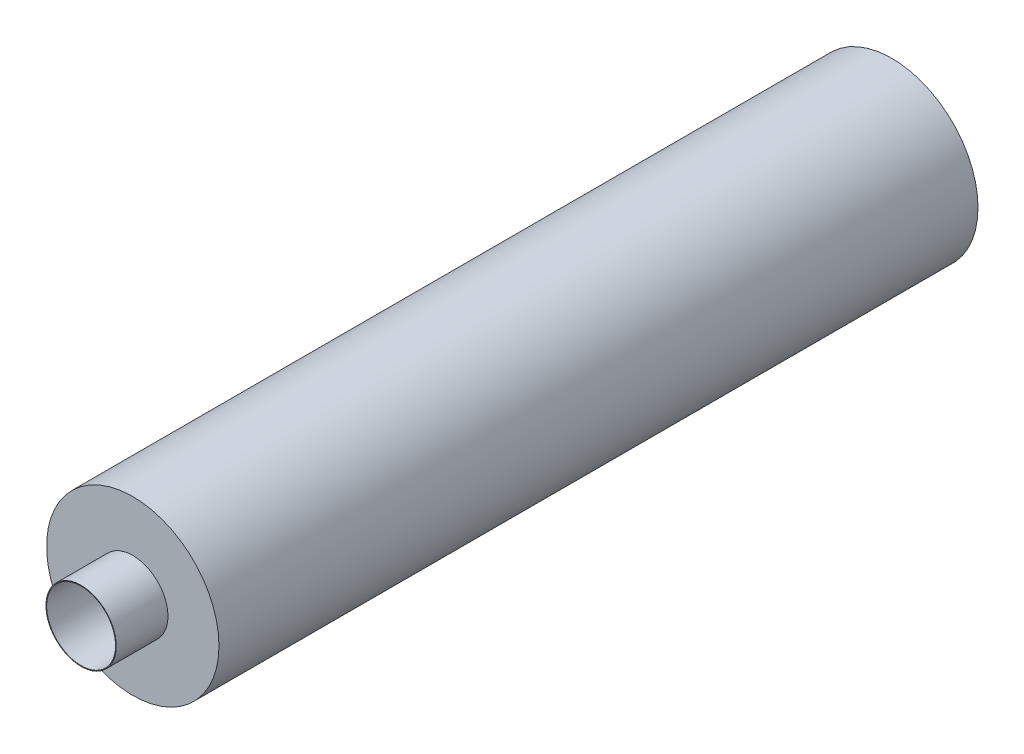
ISO-10303-21;
HEADER;
FILE_DESCRIPTION(('STEP AP214'),'2;1');
FILE_NAME('part.step','',(''),(''),'','','');
FILE_SCHEMA(('AUTOMOTIVE_DESIGN { 1 0 10303 214 1 1 1 1 }'));
ENDSEC;
DATA;
#1=APPLICATION_CONTEXT('core data for automotive mechanical design processes');
#2=APPLICATION_PROTOCOL_DEFINITION('international standard','automotive_design',2000,#1);
#3=PRODUCT_CONTEXT('',#1,'mechanical');
#4=PRODUCT('Part','Part','',(#3));
#5=PRODUCT_RELATED_PRODUCT_CATEGORY('part','',(#4));
#6=PRODUCT_DEFINITION_FORMATION('','',#4);
#7=PRODUCT_DEFINITION_CONTEXT('part definition',#1,'design');
#8=PRODUCT_DEFINITION('design','',#6,#7);
#9=PRODUCT_DEFINITION_SHAPE('','',#8);
#10=(LENGTH_UNIT() NAMED_UNIT(*) SI_UNIT(.MILLI.,.METRE.));
#11=(NAMED_UNIT(*) PLANE_ANGLE_UNIT() SI_UNIT($,.RADIAN.));
#12=(NAMED_UNIT(*) SI_UNIT($,.STERADIAN.) SOLID_ANGLE_UNIT());
#13=UNCERTAINTY_MEASURE_WITH_UNIT(LENGTH_MEASURE(1.E-05),#10,'distance_accuracy_value','');
#14=(GEOMETRIC_REPRESENTATION_CONTEXT(3) GLOBAL_UNCERTAINTY_ASSIGNED_CONTEXT((#13)) GLOBAL_UNIT_ASSIGNED_CONTEXT((#10,
#11,#12)) REPRESENTATION_CONTEXT('',''));
#15=CARTESIAN_POINT('',(0.,0.,0.));
#16=DIRECTION('',(0.,0.,1.));
#17=DIRECTION('',(1.,0.,0.));
#18=AXIS2_PLACEMENT_3D('',#15,#16,#17);
#19=CARTESIAN_POINT('',(0.,0.,2200.));
#20=DIRECTION('',(0.,0.,1.));
#21=DIRECTION('',(1.,0.,0.));
#22=AXIS2_PLACEMENT_3D('',#19,#20,#21);
#23=PLANE('',#22);
#24=CARTESIAN_POINT('',(0.,0.,2200.));
#25=DIRECTION('',(0.,0.,1.));
#26=DIRECTION('',(1.,0.,0.));
#27=AXIS2_PLACEMENT_3D('',#24,#25,#26);
#28=CIRCLE('',#27,100.);
#29=CARTESIAN_POINT('',(100.,0.,2200.));
#30=VERTEX_POINT('',#29);
#31=EDGE_CURVE('E67',#30,#30,#28,.T.);
#32=ORIENTED_EDGE('',*,*,#31,.T.);
#33=EDGE_LOOP('',(#32));
#34=FACE_BOUND('',#33,.T.);
#35=CARTESIAN_POINT('',(0.,0.,2200.));
#36=DIRECTION('',(0.,0.,1.));
#37=DIRECTION('',(1.,0.,0.));
#38=AXIS2_PLACEMENT_3D('',#35,#36,#37);
#39=CIRCLE('',#38,248.);
#40=CARTESIAN_POINT('',(248.,0.,2200.));
#41=VERTEX_POINT('',#40);
#42=EDGE_CURVE('E56',#41,#41,#39,.T.);
#43=ORIENTED_EDGE('',*,*,#42,.F.);
#44=EDGE_LOOP('',(#43));
#45=FACE_BOUND('',#44,.T.);
#46=ADVANCED_FACE('F43',(#34,#45),#23,.F.);
#47=CARTESIAN_POINT('',(0.,0.,2202.));
#48=DIRECTION('',(0.,0.,-1.));
#49=DIRECTION('',(-1.,0.,0.));
#50=AXIS2_PLACEMENT_3D('',#47,#48,#49);
#51=CYLINDRICAL_SURFACE('',#50,100.);
#52=ORIENTED_EDGE('',*,*,#31,.F.);
#53=EDGE_LOOP('',(#52));
#54=FACE_BOUND('',#53,.T.);
#55=CARTESIAN_POINT('',(0.,0.,2352.));
#56=DIRECTION('',(0.,0.,1.));
#57=DIRECTION('',(1.,0.,0.));
#58=AXIS2_PLACEMENT_3D('',#55,#56,#57);
#59=CIRCLE('',#58,100.);
#60=CARTESIAN_POINT('',(100.,0.,2352.));
#61=VERTEX_POINT('',#60);
#62=EDGE_CURVE('E76',#61,#61,#59,.T.);
#63=ORIENTED_EDGE('',*,*,#62,.T.);
#64=EDGE_LOOP('',(#63));
#65=FACE_BOUND('',#64,.T.);
#66=ADVANCED_FACE('F84',(#54,#65),#51,.F.);
#67=CARTESIAN_POINT('',(0.,0.,2.));
#68=DIRECTION('',(0.,0.,1.));
#69=DIRECTION('',(1.,0.,0.));
#70=AXIS2_PLACEMENT_3D('',#67,#68,#69);
#71=PLANE('',#70);
#72=CARTESIAN_POINT('',(0.,0.,1.99999999999978));
#73=DIRECTION('',(0.,0.,1.));
#74=DIRECTION('',(1.,0.,0.));
#75=AXIS2_PLACEMENT_3D('',#72,#73,#74);
#76=CIRCLE('',#75,248.);
#77=CARTESIAN_POINT('',(248.,0.,1.99999999999978));
#78=VERTEX_POINT('',#77);
#79=EDGE_CURVE('E51',#78,#78,#76,.T.);
#80=ORIENTED_EDGE('',*,*,#79,.T.);
#81=EDGE_LOOP('',(#80));
#82=FACE_BOUND('',#81,.T.);
#83=ADVANCED_FACE('F99',(#82),#71,.T.);
#84=CARTESIAN_POINT('',(0.,0.,2200.));
#85=DIRECTION('',(0.,0.,-1.));
#86=DIRECTION('',(-1.,0.,0.));
#87=AXIS2_PLACEMENT_3D('',#84,#85,#86);
#88=CYLINDRICAL_SURFACE('',#87,248.);
#89=ORIENTED_EDGE('',*,*,#42,.T.);
#90=EDGE_LOOP('',(#89));
#91=FACE_BOUND('',#90,.T.);
#92=ORIENTED_EDGE('',*,*,#79,.F.);
#93=EDGE_LOOP('',(#92));
#94=FACE_BOUND('',#93,.T.);
#95=ADVANCED_FACE('F89',(#91,#94),#88,.F.);
#96=CARTESIAN_POINT('',(0.,0.,2352.));
#97=DIRECTION('',(0.,0.,1.));
#98=DIRECTION('',(1.,0.,0.));
#99=AXIS2_PLACEMENT_3D('',#96,#97,#98);
#100=PLANE('',#99);
#101=CARTESIAN_POINT('',(0.,0.,2352.));
#102=DIRECTION('',(0.,0.,1.));
#103=DIRECTION('',(1.,0.,0.));
#104=AXIS2_PLACEMENT_3D('',#101,#102,#103);
#105=CIRCLE('',#104,102.);
#106=CARTESIAN_POINT('',(102.,0.,2352.));
#107=VERTEX_POINT('',#106);
#108=EDGE_CURVE('E71',#107,#107,#105,.T.);
#109=ORIENTED_EDGE('',*,*,#108,.T.);
#110=EDGE_LOOP('',(#109));
#111=FACE_BOUND('',#110,.T.);
#112=ORIENTED_EDGE('',*,*,#62,.F.);
#113=EDGE_LOOP('',(#112));
#114=FACE_BOUND('',#113,.T.);
#115=ADVANCED_FACE('F86',(#111,#114),#100,.T.);
#116=CARTESIAN_POINT('',(0.,0.,2352.));
#117=DIRECTION('',(0.,0.,-1.));
#118=DIRECTION('',(-1.,0.,0.));
#119=AXIS2_PLACEMENT_3D('',#116,#117,#118);
#120=CYLINDRICAL_SURFACE('',#119,102.);
#121=ORIENTED_EDGE('',*,*,#108,.F.);
#122=EDGE_LOOP('',(#121));
#123=FACE_BOUND('',#122,.T.);
#124=CARTESIAN_POINT('',(0.,0.,2202.));
#125=DIRECTION('',(0.,0.,1.));
#126=DIRECTION('',(1.,0.,0.));
#127=AXIS2_PLACEMENT_3D('',#124,#125,#126);
#128=CIRCLE('',#127,102.);
#129=CARTESIAN_POINT('',(102.,0.,2202.));
#130=VERTEX_POINT('',#129);
#131=EDGE_CURVE('E72',#130,#130,#128,.T.);
#132=ORIENTED_EDGE('',*,*,#131,.T.);
#133=EDGE_LOOP('',(#132));
#134=FACE_BOUND('',#133,.T.);
#135=ADVANCED_FACE('F88',(#123,#134),#120,.T.);
#136=CARTESIAN_POINT('',(0.,0.,0.));
#137=DIRECTION('',(0.,0.,1.));
#138=DIRECTION('',(1.,0.,0.));
#139=AXIS2_PLACEMENT_3D('',#136,#137,#138);
#140=PLANE('',#139);
#141=CARTESIAN_POINT('',(0.,0.,0.));
#142=DIRECTION('',(0.,0.,1.));
#143=DIRECTION('',(1.,0.,0.));
#144=AXIS2_PLACEMENT_3D('',#141,#142,#143);
#145=CIRCLE('',#144,250.);
#146=CARTESIAN_POINT('',(250.,0.,0.));
#147=VERTEX_POINT('',#146);
#148=EDGE_CURVE('E11',#147,#147,#145,.T.);
#149=ORIENTED_EDGE('',*,*,#148,.F.);
#150=EDGE_LOOP('',(#149));
#151=FACE_BOUND('',#150,.T.);
#152=ADVANCED_FACE('F96',(#151),#140,.F.);
#153=CARTESIAN_POINT('',(0.,0.,2200.));
#154=DIRECTION('',(0.,0.,-1.));
#155=DIRECTION('',(-1.,0.,0.));
#156=AXIS2_PLACEMENT_3D('',#153,#154,#155);
#157=CYLINDRICAL_SURFACE('',#156,250.);
#158=ORIENTED_EDGE('',*,*,#148,.T.);
#159=EDGE_LOOP('',(#158));
#160=FACE_BOUND('',#159,.T.);
#161=CARTESIAN_POINT('',(0.,0.,2202.));
#162=DIRECTION('',(0.,0.,1.));
#163=DIRECTION('',(1.,0.,0.));
#164=AXIS2_PLACEMENT_3D('',#161,#162,#163);
#165=CIRCLE('',#164,250.);
#166=CARTESIAN_POINT('',(250.,0.,2202.));
#167=VERTEX_POINT('',#166);
#168=EDGE_CURVE('E62',#167,#167,#165,.T.);
#169=ORIENTED_EDGE('',*,*,#168,.F.);
#170=EDGE_LOOP('',(#169));
#171=FACE_BOUND('',#170,.T.);
#172=ADVANCED_FACE('F45',(#160,#171),#157,.T.);
#173=CARTESIAN_POINT('',(0.,0.,2202.));
#174=DIRECTION('',(0.,0.,1.));
#175=DIRECTION('',(1.,0.,0.));
#176=AXIS2_PLACEMENT_3D('',#173,#174,#175);
#177=PLANE('',#176);
#178=ORIENTED_EDGE('',*,*,#168,.T.);
#179=EDGE_LOOP('',(#178));
#180=FACE_BOUND('',#179,.T.);
#181=ORIENTED_EDGE('',*,*,#131,.F.);
#182=EDGE_LOOP('',(#181));
#183=FACE_BOUND('',#182,.T.);
#184=ADVANCED_FACE('F112',(#180,#183),#177,.T.);
#185=CLOSED_SHELL('',(#46,#66,#83,#95,#115,#135,#152,#172,#184));
#186=MANIFOLD_SOLID_BREP('B2',#185);
#187=ADVANCED_BREP_SHAPE_REPRESENTATION('',(#18,#186),#14);
#188=SHAPE_DEFINITION_REPRESENTATION(#9,#187);
ENDSEC;
END-ISO-10303-21;
